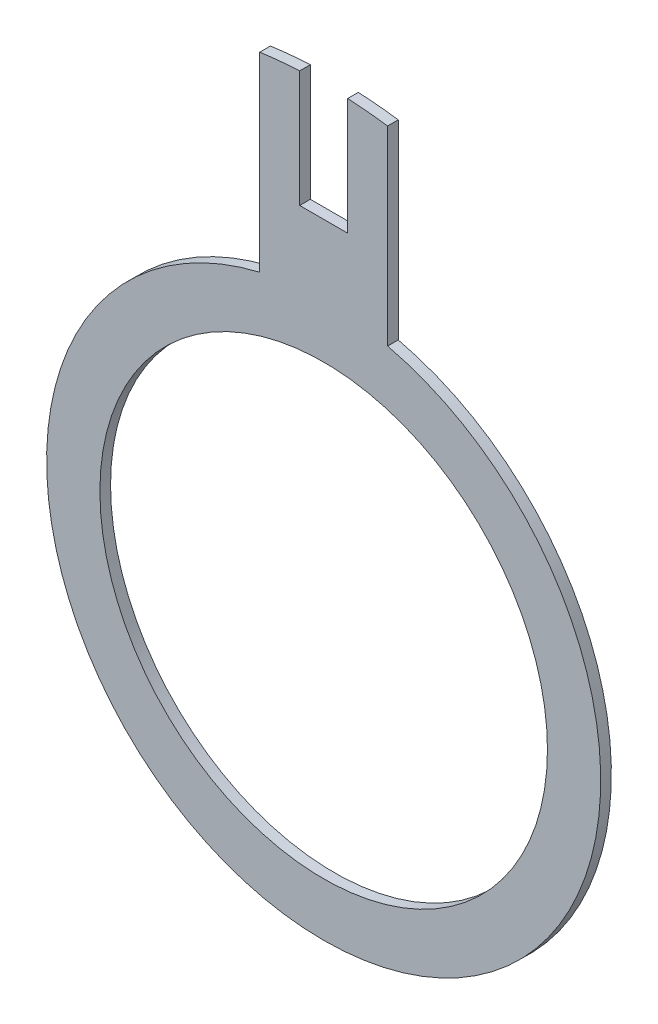
ISO-10303-21;
HEADER;
FILE_DESCRIPTION(('STEP AP214'),'2;1');
FILE_NAME('part.step','',(''),(''),'','','');
FILE_SCHEMA(('AUTOMOTIVE_DESIGN { 1 0 10303 214 1 1 1 1 }'));
ENDSEC;
DATA;
#1=APPLICATION_CONTEXT('core data for automotive mechanical design processes');
#2=APPLICATION_PROTOCOL_DEFINITION('international standard','automotive_design',2000,#1);
#3=PRODUCT_CONTEXT('',#1,'mechanical');
#4=PRODUCT('Part','Part','',(#3));
#5=PRODUCT_RELATED_PRODUCT_CATEGORY('part','',(#4));
#6=PRODUCT_DEFINITION_FORMATION('','',#4);
#7=PRODUCT_DEFINITION_CONTEXT('part definition',#1,'design');
#8=PRODUCT_DEFINITION('design','',#6,#7);
#9=PRODUCT_DEFINITION_SHAPE('','',#8);
#10=(LENGTH_UNIT() NAMED_UNIT(*) SI_UNIT(.MILLI.,.METRE.));
#11=(NAMED_UNIT(*) PLANE_ANGLE_UNIT() SI_UNIT($,.RADIAN.));
#12=(NAMED_UNIT(*) SI_UNIT($,.STERADIAN.) SOLID_ANGLE_UNIT());
#13=UNCERTAINTY_MEASURE_WITH_UNIT(LENGTH_MEASURE(1.E-05),#10,'distance_accuracy_value','');
#14=(GEOMETRIC_REPRESENTATION_CONTEXT(3) GLOBAL_UNCERTAINTY_ASSIGNED_CONTEXT((#13)) GLOBAL_UNIT_ASSIGNED_CONTEXT((#10,
#11,#12)) REPRESENTATION_CONTEXT('',''));
#15=CARTESIAN_POINT('',(0.,0.,0.));
#16=DIRECTION('',(0.,0.,1.));
#17=DIRECTION('',(1.,0.,0.));
#18=AXIS2_PLACEMENT_3D('',#15,#16,#17);
#19=CARTESIAN_POINT('',(0.,0.,0.1));
#20=DIRECTION('',(0.,0.,-1.));
#21=DIRECTION('',(-1.,0.,0.));
#22=AXIS2_PLACEMENT_3D('',#19,#20,#21);
#23=PLANE('',#22);
#24=DIRECTION('',(-1.,2.94710243863171E-12,0.));
#25=VECTOR('',#24,1.);
#26=CARTESIAN_POINT('',(-0.225,3.26000000000816,0.1));
#27=LINE('',#26,#25);
#28=CARTESIAN_POINT('',(0.225,3.26000000000683,0.1));
#29=VERTEX_POINT('',#28);
#30=CARTESIAN_POINT('',(-0.225,3.26000000000816,0.1));
#31=VERTEX_POINT('',#30);
#32=EDGE_CURVE('E144',#29,#31,#27,.T.);
#33=ORIENTED_EDGE('',*,*,#32,.T.);
#34=DIRECTION('',(0.,1.,0.));
#35=VECTOR('',#34,1.);
#36=CARTESIAN_POINT('',(-0.225,4.35419051030154,0.1));
#37=LINE('',#36,#35);
#38=CARTESIAN_POINT('',(-0.225,4.35419051030154,0.1));
#39=VERTEX_POINT('',#38);
#40=EDGE_CURVE('E92',#31,#39,#37,.T.);
#41=ORIENTED_EDGE('',*,*,#40,.T.);
#42=CARTESIAN_POINT('',(0.,0.,0.1));
#43=DIRECTION('',(0.,0.,1.));
#44=DIRECTION('',(-1.,0.,0.));
#45=AXIS2_PLACEMENT_3D('',#42,#43,#44);
#46=CIRCLE('',#45,4.36);
#47=CARTESIAN_POINT('',(-0.6,4.31851826440505,0.1));
#48=VERTEX_POINT('',#47);
#49=EDGE_CURVE('E159',#39,#48,#46,.T.);
#50=ORIENTED_EDGE('',*,*,#49,.T.);
#51=DIRECTION('',(0.,-1.,0.));
#52=VECTOR('',#51,1.);
#53=CARTESIAN_POINT('',(-0.6,2.5298221281347,0.1));
#54=LINE('',#53,#52);
#55=CARTESIAN_POINT('',(-0.6,2.5298221281347,0.1));
#56=VERTEX_POINT('',#55);
#57=EDGE_CURVE('E172',#48,#56,#54,.T.);
#58=ORIENTED_EDGE('',*,*,#57,.T.);
#59=CARTESIAN_POINT('',(0.,0.,0.1));
#60=DIRECTION('',(0.,0.,1.));
#61=DIRECTION('',(1.,0.,0.));
#62=AXIS2_PLACEMENT_3D('',#59,#60,#61);
#63=CIRCLE('',#62,2.6);
#64=CARTESIAN_POINT('',(0.599999999999999,2.5298221281347,0.1));
#65=VERTEX_POINT('',#64);
#66=EDGE_CURVE('E111',#56,#65,#63,.T.);
#67=ORIENTED_EDGE('',*,*,#66,.T.);
#68=DIRECTION('',(0.,1.,0.));
#69=VECTOR('',#68,1.);
#70=CARTESIAN_POINT('',(0.6,4.31851826440505,0.1));
#71=LINE('',#70,#69);
#72=CARTESIAN_POINT('',(0.6,4.31851826440505,0.1));
#73=VERTEX_POINT('',#72);
#74=EDGE_CURVE('E105',#65,#73,#71,.T.);
#75=ORIENTED_EDGE('',*,*,#74,.T.);
#76=CARTESIAN_POINT('',(0.,0.,0.1));
#77=DIRECTION('',(0.,0.,1.));
#78=DIRECTION('',(-1.,0.,0.));
#79=AXIS2_PLACEMENT_3D('',#76,#77,#78);
#80=CIRCLE('',#79,4.36);
#81=CARTESIAN_POINT('',(0.225,4.35419051030154,0.1));
#82=VERTEX_POINT('',#81);
#83=EDGE_CURVE('E109',#73,#82,#80,.T.);
#84=ORIENTED_EDGE('',*,*,#83,.T.);
#85=DIRECTION('',(0.,-1.,0.));
#86=VECTOR('',#85,1.);
#87=CARTESIAN_POINT('',(0.225,3.26000000000683,0.1));
#88=LINE('',#87,#86);
#89=EDGE_CURVE('E49',#82,#29,#88,.T.);
#90=ORIENTED_EDGE('',*,*,#89,.T.);
#91=EDGE_LOOP('',(#33,#41,#50,#58,#67,#75,#84,#90));
#92=FACE_BOUND('',#91,.T.);
#93=CARTESIAN_POINT('',(0.,0.,0.1));
#94=DIRECTION('',(0.,0.,1.));
#95=DIRECTION('',(1.,0.,0.));
#96=AXIS2_PLACEMENT_3D('',#93,#94,#95);
#97=CIRCLE('',#96,2.1);
#98=CARTESIAN_POINT('',(2.1,0.,0.1));
#99=VERTEX_POINT('',#98);
#100=EDGE_CURVE('E133',#99,#99,#97,.T.);
#101=ORIENTED_EDGE('',*,*,#100,.F.);
#102=EDGE_LOOP('',(#101));
#103=FACE_BOUND('',#102,.T.);
#104=ADVANCED_FACE('F32',(#92,#103),#23,.F.);
#105=CARTESIAN_POINT('',(0.,0.,0.));
#106=DIRECTION('',(0.,0.,-1.));
#107=DIRECTION('',(-1.,0.,0.));
#108=AXIS2_PLACEMENT_3D('',#105,#106,#107);
#109=PLANE('',#108);
#110=DIRECTION('',(-1.,2.94710243863171E-12,0.));
#111=VECTOR('',#110,1.);
#112=CARTESIAN_POINT('',(-0.225,3.26000000000816,0.));
#113=LINE('',#112,#111);
#114=CARTESIAN_POINT('',(0.225,3.26000000000683,0.));
#115=VERTEX_POINT('',#114);
#116=CARTESIAN_POINT('',(-0.225,3.26000000000816,0.));
#117=VERTEX_POINT('',#116);
#118=EDGE_CURVE('E129',#115,#117,#113,.T.);
#119=ORIENTED_EDGE('',*,*,#118,.F.);
#120=DIRECTION('',(0.,-1.,0.));
#121=VECTOR('',#120,1.);
#122=CARTESIAN_POINT('',(0.225,3.26000000000683,0.));
#123=LINE('',#122,#121);
#124=CARTESIAN_POINT('',(0.225,4.35419051030154,0.));
#125=VERTEX_POINT('',#124);
#126=EDGE_CURVE('E84',#125,#115,#123,.T.);
#127=ORIENTED_EDGE('',*,*,#126,.F.);
#128=CARTESIAN_POINT('',(0.,0.,0.));
#129=DIRECTION('',(0.,0.,1.));
#130=DIRECTION('',(-1.,0.,0.));
#131=AXIS2_PLACEMENT_3D('',#128,#129,#130);
#132=CIRCLE('',#131,4.36);
#133=CARTESIAN_POINT('',(0.6,4.31851826440505,0.));
#134=VERTEX_POINT('',#133);
#135=EDGE_CURVE('E78',#134,#125,#132,.T.);
#136=ORIENTED_EDGE('',*,*,#135,.F.);
#137=DIRECTION('',(0.,1.,0.));
#138=VECTOR('',#137,1.);
#139=CARTESIAN_POINT('',(0.6,4.31851826440505,0.));
#140=LINE('',#139,#138);
#141=CARTESIAN_POINT('',(0.599999999999999,2.5298221281347,0.));
#142=VERTEX_POINT('',#141);
#143=EDGE_CURVE('E119',#142,#134,#140,.T.);
#144=ORIENTED_EDGE('',*,*,#143,.F.);
#145=CARTESIAN_POINT('',(0.,0.,0.));
#146=DIRECTION('',(0.,0.,1.));
#147=DIRECTION('',(1.,0.,0.));
#148=AXIS2_PLACEMENT_3D('',#145,#146,#147);
#149=CIRCLE('',#148,2.6);
#150=CARTESIAN_POINT('',(-0.6,2.5298221281347,0.));
#151=VERTEX_POINT('',#150);
#152=EDGE_CURVE('E139',#151,#142,#149,.T.);
#153=ORIENTED_EDGE('',*,*,#152,.F.);
#154=DIRECTION('',(0.,-1.,0.));
#155=VECTOR('',#154,1.);
#156=CARTESIAN_POINT('',(-0.6,2.5298221281347,0.));
#157=LINE('',#156,#155);
#158=CARTESIAN_POINT('',(-0.6,4.31851826440505,0.));
#159=VERTEX_POINT('',#158);
#160=EDGE_CURVE('E137',#159,#151,#157,.T.);
#161=ORIENTED_EDGE('',*,*,#160,.F.);
#162=CARTESIAN_POINT('',(0.,0.,0.));
#163=DIRECTION('',(0.,0.,1.));
#164=DIRECTION('',(-1.,0.,0.));
#165=AXIS2_PLACEMENT_3D('',#162,#163,#164);
#166=CIRCLE('',#165,4.36);
#167=CARTESIAN_POINT('',(-0.225,4.35419051030154,0.));
#168=VERTEX_POINT('',#167);
#169=EDGE_CURVE('E135',#168,#159,#166,.T.);
#170=ORIENTED_EDGE('',*,*,#169,.F.);
#171=DIRECTION('',(0.,1.,0.));
#172=VECTOR('',#171,1.);
#173=CARTESIAN_POINT('',(-0.225,4.35419051030154,0.));
#174=LINE('',#173,#172);
#175=EDGE_CURVE('E132',#117,#168,#174,.T.);
#176=ORIENTED_EDGE('',*,*,#175,.F.);
#177=EDGE_LOOP('',(#119,#127,#136,#144,#153,#161,#170,#176));
#178=FACE_BOUND('',#177,.T.);
#179=CARTESIAN_POINT('',(0.,0.,0.));
#180=DIRECTION('',(0.,0.,1.));
#181=DIRECTION('',(1.,0.,0.));
#182=AXIS2_PLACEMENT_3D('',#179,#180,#181);
#183=CIRCLE('',#182,2.1);
#184=CARTESIAN_POINT('',(2.1,0.,0.));
#185=VERTEX_POINT('',#184);
#186=EDGE_CURVE('E178',#185,#185,#183,.T.);
#187=ORIENTED_EDGE('',*,*,#186,.T.);
#188=EDGE_LOOP('',(#187));
#189=FACE_BOUND('',#188,.T.);
#190=ADVANCED_FACE('F163',(#178,#189),#109,.T.);
#191=CARTESIAN_POINT('',(-0.225,3.26000000000816,0.1));
#192=DIRECTION('',(-2.94710243863171E-12,-1.,0.));
#193=DIRECTION('',(1.,-2.94710243863171E-12,0.));
#194=AXIS2_PLACEMENT_3D('',#191,#192,#193);
#195=PLANE('',#194);
#196=ORIENTED_EDGE('',*,*,#118,.T.);
#197=DIRECTION('',(0.,0.,-1.));
#198=VECTOR('',#197,1.);
#199=CARTESIAN_POINT('',(-0.225,3.26000000000816,0.1));
#200=LINE('',#199,#198);
#201=EDGE_CURVE('E11',#31,#117,#200,.T.);
#202=ORIENTED_EDGE('',*,*,#201,.F.);
#203=ORIENTED_EDGE('',*,*,#32,.F.);
#204=DIRECTION('',(0.,0.,-1.));
#205=VECTOR('',#204,1.);
#206=CARTESIAN_POINT('',(0.225,3.26000000000683,0.1));
#207=LINE('',#206,#205);
#208=EDGE_CURVE('E125',#29,#115,#207,.T.);
#209=ORIENTED_EDGE('',*,*,#208,.T.);
#210=EDGE_LOOP('',(#196,#202,#203,#209));
#211=FACE_BOUND('',#210,.T.);
#212=ADVANCED_FACE('F34',(#211),#195,.F.);
#213=CARTESIAN_POINT('',(-0.225,4.35419051030154,0.1));
#214=DIRECTION('',(-1.,0.,0.));
#215=DIRECTION('',(0.,0.,1.));
#216=AXIS2_PLACEMENT_3D('',#213,#214,#215);
#217=PLANE('',#216);
#218=ORIENTED_EDGE('',*,*,#175,.T.);
#219=DIRECTION('',(0.,0.,-1.));
#220=VECTOR('',#219,1.);
#221=CARTESIAN_POINT('',(-0.225,4.35419051030154,0.1));
#222=LINE('',#221,#220);
#223=EDGE_CURVE('E41',#39,#168,#222,.T.);
#224=ORIENTED_EDGE('',*,*,#223,.F.);
#225=ORIENTED_EDGE('',*,*,#40,.F.);
#226=ORIENTED_EDGE('',*,*,#201,.T.);
#227=EDGE_LOOP('',(#218,#224,#225,#226));
#228=FACE_BOUND('',#227,.T.);
#229=ADVANCED_FACE('F206',(#228),#217,.F.);
#230=CARTESIAN_POINT('',(0.,0.,0.1));
#231=DIRECTION('',(0.,0.,-1.));
#232=DIRECTION('',(-1.,0.,0.));
#233=AXIS2_PLACEMENT_3D('',#230,#231,#232);
#234=CYLINDRICAL_SURFACE('',#233,4.36);
#235=ORIENTED_EDGE('',*,*,#169,.T.);
#236=DIRECTION('',(0.,0.,-1.));
#237=VECTOR('',#236,1.);
#238=CARTESIAN_POINT('',(-0.6,4.31851826440505,0.1));
#239=LINE('',#238,#237);
#240=EDGE_CURVE('E151',#48,#159,#239,.T.);
#241=ORIENTED_EDGE('',*,*,#240,.F.);
#242=ORIENTED_EDGE('',*,*,#49,.F.);
#243=ORIENTED_EDGE('',*,*,#223,.T.);
#244=EDGE_LOOP('',(#235,#241,#242,#243));
#245=FACE_BOUND('',#244,.T.);
#246=ADVANCED_FACE('F157',(#245),#234,.T.);
#247=CARTESIAN_POINT('',(-0.6,2.5298221281347,0.1));
#248=DIRECTION('',(1.,0.,0.));
#249=DIRECTION('',(0.,0.,-1.));
#250=AXIS2_PLACEMENT_3D('',#247,#248,#249);
#251=PLANE('',#250);
#252=ORIENTED_EDGE('',*,*,#160,.T.);
#253=DIRECTION('',(0.,0.,-1.));
#254=VECTOR('',#253,1.);
#255=CARTESIAN_POINT('',(-0.6,2.5298221281347,0.1));
#256=LINE('',#255,#254);
#257=EDGE_CURVE('E148',#56,#151,#256,.T.);
#258=ORIENTED_EDGE('',*,*,#257,.F.);
#259=ORIENTED_EDGE('',*,*,#57,.F.);
#260=ORIENTED_EDGE('',*,*,#240,.T.);
#261=EDGE_LOOP('',(#252,#258,#259,#260));
#262=FACE_BOUND('',#261,.T.);
#263=ADVANCED_FACE('F168',(#262),#251,.F.);
#264=CARTESIAN_POINT('',(0.,0.,0.1));
#265=DIRECTION('',(0.,0.,-1.));
#266=DIRECTION('',(-1.,0.,0.));
#267=AXIS2_PLACEMENT_3D('',#264,#265,#266);
#268=CYLINDRICAL_SURFACE('',#267,2.6);
#269=ORIENTED_EDGE('',*,*,#152,.T.);
#270=DIRECTION('',(0.,0.,-1.));
#271=VECTOR('',#270,1.);
#272=CARTESIAN_POINT('',(0.599999999999999,2.5298221281347,0.1));
#273=LINE('',#272,#271);
#274=EDGE_CURVE('E120',#65,#142,#273,.T.);
#275=ORIENTED_EDGE('',*,*,#274,.F.);
#276=ORIENTED_EDGE('',*,*,#66,.F.);
#277=ORIENTED_EDGE('',*,*,#257,.T.);
#278=EDGE_LOOP('',(#269,#275,#276,#277));
#279=FACE_BOUND('',#278,.T.);
#280=ADVANCED_FACE('F171',(#279),#268,.T.);
#281=CARTESIAN_POINT('',(0.6,4.31851826440505,0.1));
#282=DIRECTION('',(-1.,0.,0.));
#283=DIRECTION('',(0.,0.,1.));
#284=AXIS2_PLACEMENT_3D('',#281,#282,#283);
#285=PLANE('',#284);
#286=ORIENTED_EDGE('',*,*,#143,.T.);
#287=DIRECTION('',(0.,0.,-1.));
#288=VECTOR('',#287,1.);
#289=CARTESIAN_POINT('',(0.6,4.31851826440505,0.1));
#290=LINE('',#289,#288);
#291=EDGE_CURVE('E116',#73,#134,#290,.T.);
#292=ORIENTED_EDGE('',*,*,#291,.F.);
#293=ORIENTED_EDGE('',*,*,#74,.F.);
#294=ORIENTED_EDGE('',*,*,#274,.T.);
#295=EDGE_LOOP('',(#286,#292,#293,#294));
#296=FACE_BOUND('',#295,.T.);
#297=ADVANCED_FACE('F117',(#296),#285,.F.);
#298=CARTESIAN_POINT('',(0.,0.,0.1));
#299=DIRECTION('',(0.,0.,-1.));
#300=DIRECTION('',(-1.,0.,0.));
#301=AXIS2_PLACEMENT_3D('',#298,#299,#300);
#302=CYLINDRICAL_SURFACE('',#301,4.36);
#303=ORIENTED_EDGE('',*,*,#135,.T.);
#304=DIRECTION('',(0.,0.,-1.));
#305=VECTOR('',#304,1.);
#306=CARTESIAN_POINT('',(0.225,4.35419051030154,0.1));
#307=LINE('',#306,#305);
#308=EDGE_CURVE('E121',#82,#125,#307,.T.);
#309=ORIENTED_EDGE('',*,*,#308,.F.);
#310=ORIENTED_EDGE('',*,*,#83,.F.);
#311=ORIENTED_EDGE('',*,*,#291,.T.);
#312=EDGE_LOOP('',(#303,#309,#310,#311));
#313=FACE_BOUND('',#312,.T.);
#314=ADVANCED_FACE('F123',(#313),#302,.T.);
#315=CARTESIAN_POINT('',(0.225,3.26000000000683,0.1));
#316=DIRECTION('',(1.,0.,0.));
#317=DIRECTION('',(0.,0.,-1.));
#318=AXIS2_PLACEMENT_3D('',#315,#316,#317);
#319=PLANE('',#318);
#320=ORIENTED_EDGE('',*,*,#126,.T.);
#321=ORIENTED_EDGE('',*,*,#208,.F.);
#322=ORIENTED_EDGE('',*,*,#89,.F.);
#323=ORIENTED_EDGE('',*,*,#308,.T.);
#324=EDGE_LOOP('',(#320,#321,#322,#323));
#325=FACE_BOUND('',#324,.T.);
#326=ADVANCED_FACE('F194',(#325),#319,.F.);
#327=CARTESIAN_POINT('',(0.,0.,0.1));
#328=DIRECTION('',(0.,0.,-1.));
#329=DIRECTION('',(-1.,0.,0.));
#330=AXIS2_PLACEMENT_3D('',#327,#328,#329);
#331=CYLINDRICAL_SURFACE('',#330,2.1);
#332=ORIENTED_EDGE('',*,*,#100,.T.);
#333=EDGE_LOOP('',(#332));
#334=FACE_BOUND('',#333,.T.);
#335=ORIENTED_EDGE('',*,*,#186,.F.);
#336=EDGE_LOOP('',(#335));
#337=FACE_BOUND('',#336,.T.);
#338=ADVANCED_FACE('F184',(#334,#337),#331,.F.);
#339=CLOSED_SHELL('',(#104,#190,#212,#229,#246,#263,#280,#297,#314,#326,#338));
#340=MANIFOLD_SOLID_BREP('B2',#339);
#341=ADVANCED_BREP_SHAPE_REPRESENTATION('',(#18,#340),#14);
#342=SHAPE_DEFINITION_REPRESENTATION(#9,#341);
ENDSEC;
END-ISO-10303-21;
